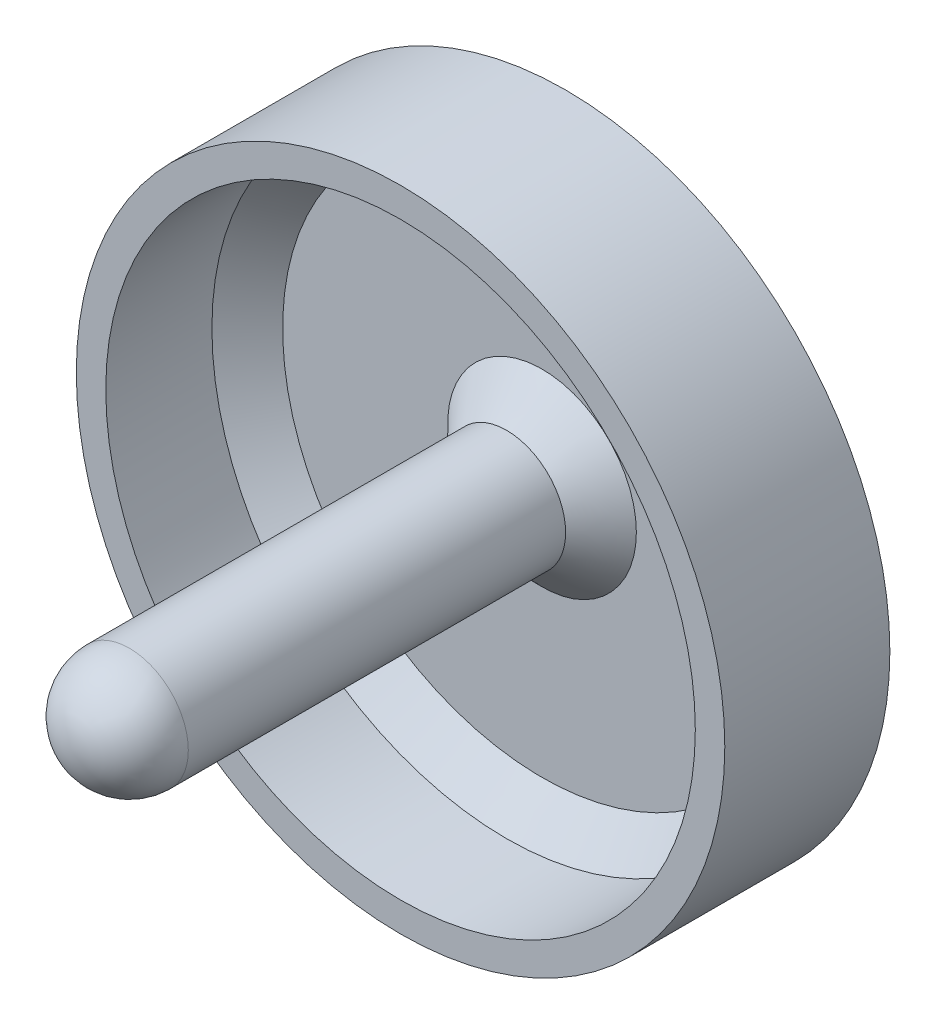
ISO-10303-21;
HEADER;
FILE_DESCRIPTION(('STEP AP214'),'2;1');
FILE_NAME('part.step','',(''),(''),'','','');
FILE_SCHEMA(('AUTOMOTIVE_DESIGN { 1 0 10303 214 1 1 1 1 }'));
ENDSEC;
DATA;
#1=APPLICATION_CONTEXT('core data for automotive mechanical design processes');
#2=APPLICATION_PROTOCOL_DEFINITION('international standard','automotive_design',2000,#1);
#3=PRODUCT_CONTEXT('',#1,'mechanical');
#4=PRODUCT('Part','Part','',(#3));
#5=PRODUCT_RELATED_PRODUCT_CATEGORY('part','',(#4));
#6=PRODUCT_DEFINITION_FORMATION('','',#4);
#7=PRODUCT_DEFINITION_CONTEXT('part definition',#1,'design');
#8=PRODUCT_DEFINITION('design','',#6,#7);
#9=PRODUCT_DEFINITION_SHAPE('','',#8);
#10=(LENGTH_UNIT() NAMED_UNIT(*) SI_UNIT(.MILLI.,.METRE.));
#11=(NAMED_UNIT(*) PLANE_ANGLE_UNIT() SI_UNIT($,.RADIAN.));
#12=(NAMED_UNIT(*) SI_UNIT($,.STERADIAN.) SOLID_ANGLE_UNIT());
#13=UNCERTAINTY_MEASURE_WITH_UNIT(LENGTH_MEASURE(1.E-05),#10,'distance_accuracy_value','');
#14=(GEOMETRIC_REPRESENTATION_CONTEXT(3) GLOBAL_UNCERTAINTY_ASSIGNED_CONTEXT((#13)) GLOBAL_UNIT_ASSIGNED_CONTEXT((#10,
#11,#12)) REPRESENTATION_CONTEXT('',''));
#15=CARTESIAN_POINT('',(0.,0.,0.));
#16=DIRECTION('',(0.,0.,1.));
#17=DIRECTION('',(1.,0.,0.));
#18=AXIS2_PLACEMENT_3D('',#15,#16,#17);
#19=CARTESIAN_POINT('',(0.,0.,2.));
#20=DIRECTION('',(0.,0.,1.));
#21=DIRECTION('',(1.,0.,0.));
#22=AXIS2_PLACEMENT_3D('',#19,#20,#21);
#23=PLANE('',#22);
#24=CARTESIAN_POINT('',(0.,0.,2.));
#25=DIRECTION('',(0.,0.,1.));
#26=DIRECTION('',(1.,0.,0.));
#27=AXIS2_PLACEMENT_3D('',#24,#25,#26);
#28=CIRCLE('',#27,7.99999999999997);
#29=CARTESIAN_POINT('',(7.99999999999997,0.,2.));
#30=VERTEX_POINT('',#29);
#31=EDGE_CURVE('E39',#30,#30,#28,.F.);
#32=ORIENTED_EDGE('',*,*,#31,.T.);
#33=EDGE_LOOP('',(#32));
#34=FACE_BOUND('',#33,.T.);
#35=CARTESIAN_POINT('',(0.,0.,2.));
#36=DIRECTION('',(0.,0.,1.));
#37=DIRECTION('',(1.,0.,0.));
#38=AXIS2_PLACEMENT_3D('',#35,#36,#37);
#39=CIRCLE('',#38,22.);
#40=CARTESIAN_POINT('',(22.,0.,2.));
#41=VERTEX_POINT('',#40);
#42=EDGE_CURVE('E47',#41,#41,#39,.T.);
#43=ORIENTED_EDGE('',*,*,#42,.T.);
#44=EDGE_LOOP('',(#43));
#45=FACE_BOUND('',#44,.T.);
#46=ADVANCED_FACE('F32',(#34,#45),#23,.T.);
#47=CARTESIAN_POINT('',(0.,0.,2.));
#48=DIRECTION('',(0.,0.,-1.));
#49=DIRECTION('',(-1.,0.,0.));
#50=AXIS2_PLACEMENT_3D('',#47,#48,#49);
#51=CYLINDRICAL_SURFACE('',#50,27.5);
#52=CARTESIAN_POINT('',(0.,0.,0.));
#53=DIRECTION('',(0.,0.,1.));
#54=DIRECTION('',(1.,0.,0.));
#55=AXIS2_PLACEMENT_3D('',#52,#53,#54);
#56=CIRCLE('',#55,27.5);
#57=CARTESIAN_POINT('',(27.5,0.,0.));
#58=VERTEX_POINT('',#57);
#59=EDGE_CURVE('E55',#58,#58,#56,.T.);
#60=ORIENTED_EDGE('',*,*,#59,.T.);
#61=EDGE_LOOP('',(#60));
#62=FACE_BOUND('',#61,.T.);
#63=CARTESIAN_POINT('',(0.,0.,14.));
#64=DIRECTION('',(0.,0.,1.));
#65=DIRECTION('',(1.,0.,0.));
#66=AXIS2_PLACEMENT_3D('',#63,#64,#65);
#67=CIRCLE('',#66,27.5);
#68=CARTESIAN_POINT('',(27.5,0.,14.));
#69=VERTEX_POINT('',#68);
#70=EDGE_CURVE('E58',#69,#69,#67,.T.);
#71=ORIENTED_EDGE('',*,*,#70,.F.);
#72=EDGE_LOOP('',(#71));
#73=FACE_BOUND('',#72,.T.);
#74=ADVANCED_FACE('F79',(#62,#73),#51,.T.);
#75=CARTESIAN_POINT('',(0.,0.,0.));
#76=DIRECTION('',(0.,0.,1.));
#77=DIRECTION('',(1.,0.,0.));
#78=AXIS2_PLACEMENT_3D('',#75,#76,#77);
#79=PLANE('',#78);
#80=ORIENTED_EDGE('',*,*,#59,.F.);
#81=EDGE_LOOP('',(#80));
#82=FACE_BOUND('',#81,.T.);
#83=ADVANCED_FACE('F69',(#82),#79,.F.);
#84=CARTESIAN_POINT('',(0.,0.,14.));
#85=DIRECTION('',(0.,0.,1.));
#86=DIRECTION('',(1.,0.,0.));
#87=AXIS2_PLACEMENT_3D('',#84,#85,#86);
#88=PLANE('',#87);
#89=ORIENTED_EDGE('',*,*,#70,.T.);
#90=EDGE_LOOP('',(#89));
#91=FACE_BOUND('',#90,.T.);
#92=CARTESIAN_POINT('',(0.,0.,14.));
#93=DIRECTION('',(0.,0.,1.));
#94=DIRECTION('',(1.,0.,0.));
#95=AXIS2_PLACEMENT_3D('',#92,#93,#94);
#96=CIRCLE('',#95,25.);
#97=CARTESIAN_POINT('',(25.,0.,14.));
#98=VERTEX_POINT('',#97);
#99=EDGE_CURVE('E61',#98,#98,#96,.T.);
#100=ORIENTED_EDGE('',*,*,#99,.F.);
#101=EDGE_LOOP('',(#100));
#102=FACE_BOUND('',#101,.T.);
#103=ADVANCED_FACE('F67',(#91,#102),#88,.T.);
#104=CARTESIAN_POINT('',(0.,0.,14.));
#105=DIRECTION('',(0.,0.,-1.));
#106=DIRECTION('',(-1.,0.,0.));
#107=AXIS2_PLACEMENT_3D('',#104,#105,#106);
#108=CYLINDRICAL_SURFACE('',#107,25.);
#109=CARTESIAN_POINT('',(0.,0.,5.));
#110=DIRECTION('',(0.,0.,1.));
#111=DIRECTION('',(1.,0.,0.));
#112=AXIS2_PLACEMENT_3D('',#109,#110,#111);
#113=CIRCLE('',#112,25.);
#114=CARTESIAN_POINT('',(25.,0.,5.));
#115=VERTEX_POINT('',#114);
#116=EDGE_CURVE('E52',#115,#115,#113,.F.);
#117=ORIENTED_EDGE('',*,*,#116,.T.);
#118=EDGE_LOOP('',(#117));
#119=FACE_BOUND('',#118,.T.);
#120=ORIENTED_EDGE('',*,*,#99,.T.);
#121=EDGE_LOOP('',(#120));
#122=FACE_BOUND('',#121,.T.);
#123=ADVANCED_FACE('F65',(#119,#122),#108,.F.);
#124=CARTESIAN_POINT('',(0.,0.,42.));
#125=DIRECTION('',(0.,0.,-1.));
#126=DIRECTION('',(-1.,0.,0.));
#127=AXIS2_PLACEMENT_3D('',#124,#125,#126);
#128=CYLINDRICAL_SURFACE('',#127,5.);
#129=CARTESIAN_POINT('',(0.,0.,37.));
#130=DIRECTION('',(0.,0.,-1.));
#131=DIRECTION('',(-1.,0.,0.));
#132=AXIS2_PLACEMENT_3D('',#129,#130,#131);
#133=CIRCLE('',#132,5.);
#134=CARTESIAN_POINT('',(-5.,0.,37.));
#135=VERTEX_POINT('',#134);
#136=EDGE_CURVE('E10',#135,#135,#133,.T.);
#137=ORIENTED_EDGE('',*,*,#136,.T.);
#138=EDGE_LOOP('',(#137));
#139=FACE_BOUND('',#138,.T.);
#140=CARTESIAN_POINT('',(0.,0.,5.));
#141=DIRECTION('',(0.,0.,1.));
#142=DIRECTION('',(1.,0.,0.));
#143=AXIS2_PLACEMENT_3D('',#140,#141,#142);
#144=CIRCLE('',#143,5.);
#145=CARTESIAN_POINT('',(5.,0.,5.));
#146=VERTEX_POINT('',#145);
#147=EDGE_CURVE('E43',#146,#146,#144,.T.);
#148=ORIENTED_EDGE('',*,*,#147,.T.);
#149=EDGE_LOOP('',(#148));
#150=FACE_BOUND('',#149,.T.);
#151=ADVANCED_FACE('F76',(#139,#150),#128,.T.);
#152=CARTESIAN_POINT('',(0.,0.,5.));
#153=DIRECTION('',(0.,0.,1.));
#154=DIRECTION('',(1.,0.,0.));
#155=AXIS2_PLACEMENT_3D('',#152,#153,#154);
#156=CONICAL_SURFACE('',#155,25.,0.785398163397443);
#157=ORIENTED_EDGE('',*,*,#42,.F.);
#158=EDGE_LOOP('',(#157));
#159=FACE_BOUND('',#158,.T.);
#160=ORIENTED_EDGE('',*,*,#116,.F.);
#161=EDGE_LOOP('',(#160));
#162=FACE_BOUND('',#161,.T.);
#163=ADVANCED_FACE('F91',(#159,#162),#156,.F.);
#164=CARTESIAN_POINT('',(0.,0.,5.));
#165=DIRECTION('',(0.,0.,-1.));
#166=DIRECTION('',(-1.,0.,0.));
#167=AXIS2_PLACEMENT_3D('',#164,#165,#166);
#168=CONICAL_SURFACE('',#167,5.,0.785398163397443);
#169=ORIENTED_EDGE('',*,*,#31,.F.);
#170=EDGE_LOOP('',(#169));
#171=FACE_BOUND('',#170,.T.);
#172=ORIENTED_EDGE('',*,*,#147,.F.);
#173=EDGE_LOOP('',(#172));
#174=FACE_BOUND('',#173,.T.);
#175=ADVANCED_FACE('F93',(#171,#174),#168,.T.);
#176=CARTESIAN_POINT('',(0.,0.,37.));
#177=DIRECTION('',(0.,0.,1.));
#178=DIRECTION('',(1.,0.,0.));
#179=AXIS2_PLACEMENT_3D('',#176,#177,#178);
#180=SPHERICAL_SURFACE('',#179,5.);
#181=ORIENTED_EDGE('',*,*,#136,.F.);
#182=EDGE_LOOP('',(#181));
#183=FACE_BOUND('',#182,.T.);
#184=ADVANCED_FACE('F34',(#183),#180,.T.);
#185=CLOSED_SHELL('',(#46,#74,#83,#103,#123,#151,#163,#175,#184));
#186=MANIFOLD_SOLID_BREP('B2',#185);
#187=ADVANCED_BREP_SHAPE_REPRESENTATION('',(#18,#186),#14);
#188=SHAPE_DEFINITION_REPRESENTATION(#9,#187);
ENDSEC;
END-ISO-10303-21;
